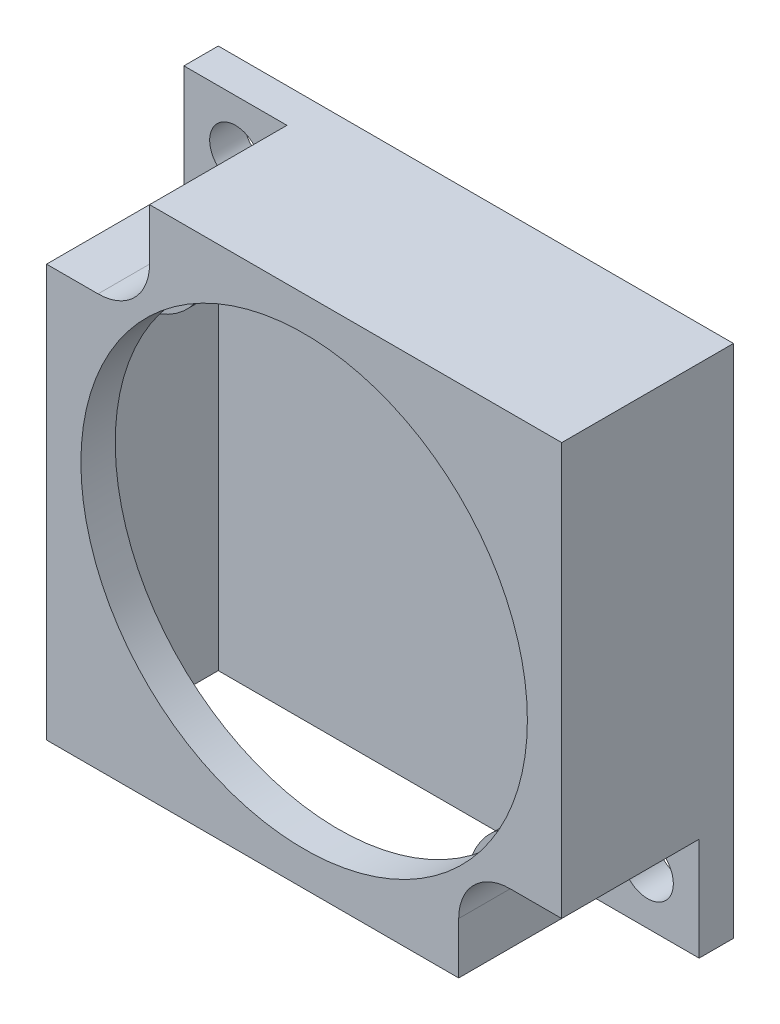
ISO-10303-21;
HEADER;
FILE_DESCRIPTION(('STEP AP214'),'2;1');
FILE_NAME('part.step','',(''),(''),'','','');
FILE_SCHEMA(('AUTOMOTIVE_DESIGN { 1 0 10303 214 1 1 1 1 }'));
ENDSEC;
DATA;
#1=APPLICATION_CONTEXT('core data for automotive mechanical design processes');
#2=APPLICATION_PROTOCOL_DEFINITION('international standard','automotive_design',2000,#1);
#3=PRODUCT_CONTEXT('',#1,'mechanical');
#4=PRODUCT('Part','Part','',(#3));
#5=PRODUCT_RELATED_PRODUCT_CATEGORY('part','',(#4));
#6=PRODUCT_DEFINITION_FORMATION('','',#4);
#7=PRODUCT_DEFINITION_CONTEXT('part definition',#1,'design');
#8=PRODUCT_DEFINITION('design','',#6,#7);
#9=PRODUCT_DEFINITION_SHAPE('','',#8);
#10=(LENGTH_UNIT() NAMED_UNIT(*) SI_UNIT(.MILLI.,.METRE.));
#11=(NAMED_UNIT(*) PLANE_ANGLE_UNIT() SI_UNIT($,.RADIAN.));
#12=(NAMED_UNIT(*) SI_UNIT($,.STERADIAN.) SOLID_ANGLE_UNIT());
#13=UNCERTAINTY_MEASURE_WITH_UNIT(LENGTH_MEASURE(1.E-05),#10,'distance_accuracy_value','');
#14=(GEOMETRIC_REPRESENTATION_CONTEXT(3) GLOBAL_UNCERTAINTY_ASSIGNED_CONTEXT((#13)) GLOBAL_UNIT_ASSIGNED_CONTEXT((#10,
#11,#12)) REPRESENTATION_CONTEXT('',''));
#15=CARTESIAN_POINT('',(0.,0.,0.));
#16=DIRECTION('',(0.,0.,1.));
#17=DIRECTION('',(1.,0.,0.));
#18=AXIS2_PLACEMENT_3D('',#15,#16,#17);
#19=CARTESIAN_POINT('',(0.,-15.,10.));
#20=DIRECTION('',(0.,1.,0.));
#21=DIRECTION('',(0.,0.,1.));
#22=AXIS2_PLACEMENT_3D('',#19,#20,#21);
#23=PLANE('',#22);
#24=DIRECTION('',(1.,0.,0.));
#25=VECTOR('',#24,1.);
#26=CARTESIAN_POINT('',(0.,-15.,0.));
#27=LINE('',#26,#25);
#28=CARTESIAN_POINT('',(-15.,-15.,0.));
#29=VERTEX_POINT('',#28);
#30=CARTESIAN_POINT('',(15.,-15.,0.));
#31=VERTEX_POINT('',#30);
#32=EDGE_CURVE('E458',#29,#31,#27,.T.);
#33=ORIENTED_EDGE('',*,*,#32,.T.);
#34=DIRECTION('',(0.,0.,-1.));
#35=VECTOR('',#34,1.);
#36=CARTESIAN_POINT('',(15.,-15.,2.));
#37=LINE('',#36,#35);
#38=CARTESIAN_POINT('',(15.,-15.,2.));
#39=VERTEX_POINT('',#38);
#40=EDGE_CURVE('E427',#39,#31,#37,.T.);
#41=ORIENTED_EDGE('',*,*,#40,.F.);
#42=DIRECTION('',(1.,0.,0.));
#43=VECTOR('',#42,1.);
#44=CARTESIAN_POINT('',(0.,-15.,2.));
#45=LINE('',#44,#43);
#46=CARTESIAN_POINT('',(8.99999999999999,-15.,2.));
#47=VERTEX_POINT('',#46);
#48=EDGE_CURVE('E417',#47,#39,#45,.T.);
#49=ORIENTED_EDGE('',*,*,#48,.F.);
#50=DIRECTION('',(0.,0.,-1.));
#51=VECTOR('',#50,1.);
#52=CARTESIAN_POINT('',(8.99999999999999,-15.,10.));
#53=LINE('',#52,#51);
#54=CARTESIAN_POINT('',(8.99999999999999,-15.,10.));
#55=VERTEX_POINT('',#54);
#56=EDGE_CURVE('E480',#55,#47,#53,.T.);
#57=ORIENTED_EDGE('',*,*,#56,.F.);
#58=DIRECTION('',(1.,0.,0.));
#59=VECTOR('',#58,1.);
#60=CARTESIAN_POINT('',(0.,-15.,10.));
#61=LINE('',#60,#59);
#62=CARTESIAN_POINT('',(-15.,-15.,10.));
#63=VERTEX_POINT('',#62);
#64=EDGE_CURVE('E478',#63,#55,#61,.T.);
#65=ORIENTED_EDGE('',*,*,#64,.F.);
#66=DIRECTION('',(0.,0.,-1.));
#67=VECTOR('',#66,1.);
#68=CARTESIAN_POINT('',(-15.,-15.,10.));
#69=LINE('',#68,#67);
#70=EDGE_CURVE('E490',#63,#29,#69,.T.);
#71=ORIENTED_EDGE('',*,*,#70,.T.);
#72=EDGE_LOOP('',(#33,#41,#49,#57,#65,#71));
#73=FACE_BOUND('',#72,.T.);
#74=DIRECTION('',(1.,0.,0.));
#75=VECTOR('',#74,1.);
#76=CARTESIAN_POINT('',(0.,-15.,1.5));
#77=LINE('',#76,#75);
#78=CARTESIAN_POINT('',(-13.5,-15.,1.5));
#79=VERTEX_POINT('',#78);
#80=CARTESIAN_POINT('',(7.49999999999999,-15.,1.5));
#81=VERTEX_POINT('',#80);
#82=EDGE_CURVE('E322',#79,#81,#77,.T.);
#83=ORIENTED_EDGE('',*,*,#82,.F.);
#84=DIRECTION('',(0.,0.,-1.));
#85=VECTOR('',#84,1.);
#86=CARTESIAN_POINT('',(-13.5,-15.,10.));
#87=LINE('',#86,#85);
#88=CARTESIAN_POINT('',(-13.5,-15.,8.5));
#89=VERTEX_POINT('',#88);
#90=EDGE_CURVE('E318',#89,#79,#87,.T.);
#91=ORIENTED_EDGE('',*,*,#90,.F.);
#92=DIRECTION('',(1.,0.,0.));
#93=VECTOR('',#92,1.);
#94=CARTESIAN_POINT('',(0.,-15.,8.5));
#95=LINE('',#94,#93);
#96=CARTESIAN_POINT('',(7.49999999999999,-15.,8.5));
#97=VERTEX_POINT('',#96);
#98=EDGE_CURVE('E53',#89,#97,#95,.T.);
#99=ORIENTED_EDGE('',*,*,#98,.T.);
#100=DIRECTION('',(0.,0.,-1.));
#101=VECTOR('',#100,1.);
#102=CARTESIAN_POINT('',(7.49999999999999,-15.,10.));
#103=LINE('',#102,#101);
#104=EDGE_CURVE('E332',#97,#81,#103,.T.);
#105=ORIENTED_EDGE('',*,*,#104,.T.);
#106=EDGE_LOOP('',(#83,#91,#99,#105));
#107=FACE_BOUND('',#106,.T.);
#108=ADVANCED_FACE('F34',(#73,#107),#23,.F.);
#109=CARTESIAN_POINT('',(0.,0.,8.));
#110=DIRECTION('',(0.,0.,1.));
#111=DIRECTION('',(1.,0.,0.));
#112=AXIS2_PLACEMENT_3D('',#109,#110,#111);
#113=PLANE('',#112);
#114=CARTESIAN_POINT('',(-12.,12.,8.));
#115=DIRECTION('',(0.,0.,1.));
#116=DIRECTION('',(1.,0.,0.));
#117=AXIS2_PLACEMENT_3D('',#114,#115,#116);
#118=CIRCLE('',#117,4.5);
#119=CARTESIAN_POINT('',(-7.79168741716336,10.4062292495033,8.));
#120=VERTEX_POINT('',#119);
#121=CARTESIAN_POINT('',(-10.4062292495033,7.79168741716336,8.));
#122=VERTEX_POINT('',#121);
#123=EDGE_CURVE('E43',#120,#122,#118,.F.);
#124=ORIENTED_EDGE('',*,*,#123,.F.);
#125=CARTESIAN_POINT('',(0.,0.,8.));
#126=DIRECTION('',(0.,0.,1.));
#127=DIRECTION('',(1.,0.,0.));
#128=AXIS2_PLACEMENT_3D('',#125,#126,#127);
#129=CIRCLE('',#128,13.);
#130=EDGE_CURVE('E404',#120,#122,#129,.T.);
#131=ORIENTED_EDGE('',*,*,#130,.T.);
#132=EDGE_LOOP('',(#124,#131));
#133=FACE_BOUND('',#132,.T.);
#134=ADVANCED_FACE('F551',(#133),#113,.T.);
#135=CARTESIAN_POINT('',(8.99999999999998,0.,10.));
#136=DIRECTION('',(1.,0.,0.));
#137=DIRECTION('',(0.,1.,0.));
#138=AXIS2_PLACEMENT_3D('',#135,#136,#137);
#139=PLANE('',#138);
#140=DIRECTION('',(0.,-1.,0.));
#141=VECTOR('',#140,1.);
#142=CARTESIAN_POINT('',(8.99999999999998,0.,2.));
#143=LINE('',#142,#141);
#144=CARTESIAN_POINT('',(8.99999999999999,-12.,2.));
#145=VERTEX_POINT('',#144);
#146=EDGE_CURVE('E414',#145,#47,#143,.T.);
#147=ORIENTED_EDGE('',*,*,#146,.F.);
#148=DIRECTION('',(0.,0.,-1.));
#149=VECTOR('',#148,1.);
#150=CARTESIAN_POINT('',(8.99999999999999,-12.,10.));
#151=LINE('',#150,#149);
#152=CARTESIAN_POINT('',(8.99999999999999,-12.,10.));
#153=VERTEX_POINT('',#152);
#154=EDGE_CURVE('E38',#153,#145,#151,.T.);
#155=ORIENTED_EDGE('',*,*,#154,.F.);
#156=DIRECTION('',(0.,-1.,0.));
#157=VECTOR('',#156,1.);
#158=CARTESIAN_POINT('',(8.99999999999998,0.,10.));
#159=LINE('',#158,#157);
#160=EDGE_CURVE('E454',#153,#55,#159,.T.);
#161=ORIENTED_EDGE('',*,*,#160,.T.);
#162=ORIENTED_EDGE('',*,*,#56,.T.);
#163=EDGE_LOOP('',(#147,#155,#161,#162));
#164=FACE_BOUND('',#163,.T.);
#165=ADVANCED_FACE('F36',(#164),#139,.T.);
#166=CARTESIAN_POINT('',(12.,-12.,10.));
#167=DIRECTION('',(0.,0.,-1.));
#168=DIRECTION('',(-1.,0.,0.));
#169=AXIS2_PLACEMENT_3D('',#166,#167,#168);
#170=CYLINDRICAL_SURFACE('',#169,2.99999999999999);
#171=ORIENTED_EDGE('',*,*,#154,.T.);
#172=CARTESIAN_POINT('',(12.,-12.,2.));
#173=DIRECTION('',(0.,0.,1.));
#174=DIRECTION('',(1.,0.,0.));
#175=AXIS2_PLACEMENT_3D('',#172,#173,#174);
#176=CIRCLE('',#175,2.99999999999999);
#177=CARTESIAN_POINT('',(12.,-9.00000000000001,2.));
#178=VERTEX_POINT('',#177);
#179=EDGE_CURVE('E412',#145,#178,#176,.F.);
#180=ORIENTED_EDGE('',*,*,#179,.T.);
#181=DIRECTION('',(0.,0.,-1.));
#182=VECTOR('',#181,1.);
#183=CARTESIAN_POINT('',(12.,-9.00000000000001,10.));
#184=LINE('',#183,#182);
#185=CARTESIAN_POINT('',(12.,-9.00000000000001,10.));
#186=VERTEX_POINT('',#185);
#187=EDGE_CURVE('E509',#186,#178,#184,.T.);
#188=ORIENTED_EDGE('',*,*,#187,.F.);
#189=CARTESIAN_POINT('',(12.,-12.,10.));
#190=DIRECTION('',(0.,0.,1.));
#191=DIRECTION('',(1.,0.,0.));
#192=AXIS2_PLACEMENT_3D('',#189,#190,#191);
#193=CIRCLE('',#192,2.99999999999999);
#194=EDGE_CURVE('E457',#153,#186,#193,.F.);
#195=ORIENTED_EDGE('',*,*,#194,.F.);
#196=EDGE_LOOP('',(#171,#180,#188,#195));
#197=FACE_BOUND('',#196,.T.);
#198=ADVANCED_FACE('F657',(#197),#170,.F.);
#199=CARTESIAN_POINT('',(0.,-9.00000000000003,10.));
#200=DIRECTION('',(0.,1.,0.));
#201=DIRECTION('',(-1.,0.,0.));
#202=AXIS2_PLACEMENT_3D('',#199,#200,#201);
#203=PLANE('',#202);
#204=ORIENTED_EDGE('',*,*,#187,.T.);
#205=DIRECTION('',(1.,0.,0.));
#206=VECTOR('',#205,1.);
#207=CARTESIAN_POINT('',(0.,-9.00000000000003,2.));
#208=LINE('',#207,#206);
#209=CARTESIAN_POINT('',(15.,-9.00000000000001,2.));
#210=VERTEX_POINT('',#209);
#211=EDGE_CURVE('E422',#178,#210,#208,.T.);
#212=ORIENTED_EDGE('',*,*,#211,.T.);
#213=DIRECTION('',(0.,0.,-1.));
#214=VECTOR('',#213,1.);
#215=CARTESIAN_POINT('',(15.,-9.00000000000001,10.));
#216=LINE('',#215,#214);
#217=CARTESIAN_POINT('',(15.,-9.00000000000001,10.));
#218=VERTEX_POINT('',#217);
#219=EDGE_CURVE('E507',#218,#210,#216,.T.);
#220=ORIENTED_EDGE('',*,*,#219,.F.);
#221=DIRECTION('',(1.,0.,0.));
#222=VECTOR('',#221,1.);
#223=CARTESIAN_POINT('',(0.,-9.00000000000003,10.));
#224=LINE('',#223,#222);
#225=EDGE_CURVE('E460',#186,#218,#224,.T.);
#226=ORIENTED_EDGE('',*,*,#225,.F.);
#227=EDGE_LOOP('',(#204,#212,#220,#226));
#228=FACE_BOUND('',#227,.T.);
#229=ADVANCED_FACE('F654',(#228),#203,.F.);
#230=CARTESIAN_POINT('',(15.,0.,10.));
#231=DIRECTION('',(1.,0.,0.));
#232=DIRECTION('',(0.,1.,0.));
#233=AXIS2_PLACEMENT_3D('',#230,#231,#232);
#234=PLANE('',#233);
#235=DIRECTION('',(0.,-1.,0.));
#236=VECTOR('',#235,1.);
#237=CARTESIAN_POINT('',(15.,0.,0.));
#238=LINE('',#237,#236);
#239=CARTESIAN_POINT('',(15.,15.,0.));
#240=VERTEX_POINT('',#239);
#241=EDGE_CURVE('E453',#240,#31,#238,.T.);
#242=ORIENTED_EDGE('',*,*,#241,.F.);
#243=DIRECTION('',(0.,0.,-1.));
#244=VECTOR('',#243,1.);
#245=CARTESIAN_POINT('',(15.,15.,10.));
#246=LINE('',#245,#244);
#247=CARTESIAN_POINT('',(15.,15.,10.));
#248=VERTEX_POINT('',#247);
#249=EDGE_CURVE('E505',#248,#240,#246,.T.);
#250=ORIENTED_EDGE('',*,*,#249,.F.);
#251=DIRECTION('',(0.,-1.,0.));
#252=VECTOR('',#251,1.);
#253=CARTESIAN_POINT('',(15.,0.,10.));
#254=LINE('',#253,#252);
#255=EDGE_CURVE('E462',#248,#218,#254,.T.);
#256=ORIENTED_EDGE('',*,*,#255,.T.);
#257=ORIENTED_EDGE('',*,*,#219,.T.);
#258=DIRECTION('',(0.,-1.,0.));
#259=VECTOR('',#258,1.);
#260=CARTESIAN_POINT('',(15.,0.,2.));
#261=LINE('',#260,#259);
#262=EDGE_CURVE('E419',#210,#39,#261,.T.);
#263=ORIENTED_EDGE('',*,*,#262,.T.);
#264=ORIENTED_EDGE('',*,*,#40,.T.);
#265=EDGE_LOOP('',(#242,#250,#256,#257,#263,#264));
#266=FACE_BOUND('',#265,.T.);
#267=ADVANCED_FACE('F650',(#266),#234,.T.);
#268=CARTESIAN_POINT('',(0.,15.,10.));
#269=DIRECTION('',(0.,1.,0.));
#270=DIRECTION('',(0.,0.,1.));
#271=AXIS2_PLACEMENT_3D('',#268,#269,#270);
#272=PLANE('',#271);
#273=DIRECTION('',(1.,0.,0.));
#274=VECTOR('',#273,1.);
#275=CARTESIAN_POINT('',(0.,15.,0.));
#276=LINE('',#275,#274);
#277=CARTESIAN_POINT('',(-15.,15.,0.));
#278=VERTEX_POINT('',#277);
#279=EDGE_CURVE('E483',#278,#240,#276,.T.);
#280=ORIENTED_EDGE('',*,*,#279,.F.);
#281=DIRECTION('',(0.,0.,-1.));
#282=VECTOR('',#281,1.);
#283=CARTESIAN_POINT('',(-15.,15.,2.));
#284=LINE('',#283,#282);
#285=CARTESIAN_POINT('',(-15.,15.,2.));
#286=VERTEX_POINT('',#285);
#287=EDGE_CURVE('E448',#286,#278,#284,.T.);
#288=ORIENTED_EDGE('',*,*,#287,.F.);
#289=DIRECTION('',(1.,0.,0.));
#290=VECTOR('',#289,1.);
#291=CARTESIAN_POINT('',(0.,15.,2.));
#292=LINE('',#291,#290);
#293=CARTESIAN_POINT('',(-9.,15.,2.));
#294=VERTEX_POINT('',#293);
#295=EDGE_CURVE('E443',#286,#294,#292,.T.);
#296=ORIENTED_EDGE('',*,*,#295,.T.);
#297=DIRECTION('',(0.,0.,-1.));
#298=VECTOR('',#297,1.);
#299=CARTESIAN_POINT('',(-9.,15.,10.));
#300=LINE('',#299,#298);
#301=CARTESIAN_POINT('',(-9.,15.,10.));
#302=VERTEX_POINT('',#301);
#303=EDGE_CURVE('E502',#302,#294,#300,.T.);
#304=ORIENTED_EDGE('',*,*,#303,.F.);
#305=DIRECTION('',(1.,0.,0.));
#306=VECTOR('',#305,1.);
#307=CARTESIAN_POINT('',(0.,15.,10.));
#308=LINE('',#307,#306);
#309=EDGE_CURVE('E465',#302,#248,#308,.T.);
#310=ORIENTED_EDGE('',*,*,#309,.T.);
#311=ORIENTED_EDGE('',*,*,#249,.T.);
#312=EDGE_LOOP('',(#280,#288,#296,#304,#310,#311));
#313=FACE_BOUND('',#312,.T.);
#314=ADVANCED_FACE('F646',(#313),#272,.T.);
#315=CARTESIAN_POINT('',(-9.,0.,10.));
#316=DIRECTION('',(-1.,0.,0.));
#317=DIRECTION('',(0.,0.,1.));
#318=AXIS2_PLACEMENT_3D('',#315,#316,#317);
#319=PLANE('',#318);
#320=DIRECTION('',(0.,1.,0.));
#321=VECTOR('',#320,1.);
#322=CARTESIAN_POINT('',(-9.,0.,2.));
#323=LINE('',#322,#321);
#324=CARTESIAN_POINT('',(-9.,12.,2.));
#325=VERTEX_POINT('',#324);
#326=EDGE_CURVE('E441',#325,#294,#323,.T.);
#327=ORIENTED_EDGE('',*,*,#326,.F.);
#328=DIRECTION('',(0.,0.,-1.));
#329=VECTOR('',#328,1.);
#330=CARTESIAN_POINT('',(-9.,12.,10.));
#331=LINE('',#330,#329);
#332=CARTESIAN_POINT('',(-9.,12.,10.));
#333=VERTEX_POINT('',#332);
#334=EDGE_CURVE('E499',#333,#325,#331,.T.);
#335=ORIENTED_EDGE('',*,*,#334,.F.);
#336=DIRECTION('',(0.,1.,0.));
#337=VECTOR('',#336,1.);
#338=CARTESIAN_POINT('',(-9.,0.,10.));
#339=LINE('',#338,#337);
#340=EDGE_CURVE('E468',#333,#302,#339,.T.);
#341=ORIENTED_EDGE('',*,*,#340,.T.);
#342=ORIENTED_EDGE('',*,*,#303,.T.);
#343=EDGE_LOOP('',(#327,#335,#341,#342));
#344=FACE_BOUND('',#343,.T.);
#345=ADVANCED_FACE('F642',(#344),#319,.T.);
#346=CARTESIAN_POINT('',(-12.,12.,10.));
#347=DIRECTION('',(0.,0.,-1.));
#348=DIRECTION('',(-1.,0.,0.));
#349=AXIS2_PLACEMENT_3D('',#346,#347,#348);
#350=CYLINDRICAL_SURFACE('',#349,3.);
#351=CARTESIAN_POINT('',(-12.,12.,2.));
#352=DIRECTION('',(0.,0.,1.));
#353=DIRECTION('',(1.,0.,0.));
#354=AXIS2_PLACEMENT_3D('',#351,#352,#353);
#355=CIRCLE('',#354,3.);
#356=CARTESIAN_POINT('',(-12.,9.,2.));
#357=VERTEX_POINT('',#356);
#358=EDGE_CURVE('E439',#357,#325,#355,.T.);
#359=ORIENTED_EDGE('',*,*,#358,.F.);
#360=DIRECTION('',(0.,0.,-1.));
#361=VECTOR('',#360,1.);
#362=CARTESIAN_POINT('',(-12.,9.,10.));
#363=LINE('',#362,#361);
#364=CARTESIAN_POINT('',(-12.,9.,10.));
#365=VERTEX_POINT('',#364);
#366=EDGE_CURVE('E496',#365,#357,#363,.T.);
#367=ORIENTED_EDGE('',*,*,#366,.F.);
#368=CARTESIAN_POINT('',(-12.,12.,10.));
#369=DIRECTION('',(0.,0.,1.));
#370=DIRECTION('',(1.,0.,0.));
#371=AXIS2_PLACEMENT_3D('',#368,#369,#370);
#372=CIRCLE('',#371,3.);
#373=EDGE_CURVE('E471',#365,#333,#372,.T.);
#374=ORIENTED_EDGE('',*,*,#373,.T.);
#375=ORIENTED_EDGE('',*,*,#334,.T.);
#376=EDGE_LOOP('',(#359,#367,#374,#375));
#377=FACE_BOUND('',#376,.T.);
#378=ADVANCED_FACE('F638',(#377),#350,.F.);
#379=CARTESIAN_POINT('',(0.,9.,10.));
#380=DIRECTION('',(0.,-1.,0.));
#381=DIRECTION('',(0.,0.,-1.));
#382=AXIS2_PLACEMENT_3D('',#379,#380,#381);
#383=PLANE('',#382);
#384=ORIENTED_EDGE('',*,*,#366,.T.);
#385=DIRECTION('',(-1.,0.,0.));
#386=VECTOR('',#385,1.);
#387=CARTESIAN_POINT('',(0.,9.,2.));
#388=LINE('',#387,#386);
#389=CARTESIAN_POINT('',(-15.,9.,2.));
#390=VERTEX_POINT('',#389);
#391=EDGE_CURVE('E436',#357,#390,#388,.T.);
#392=ORIENTED_EDGE('',*,*,#391,.T.);
#393=DIRECTION('',(0.,0.,-1.));
#394=VECTOR('',#393,1.);
#395=CARTESIAN_POINT('',(-15.,9.,10.));
#396=LINE('',#395,#394);
#397=CARTESIAN_POINT('',(-15.,9.,10.));
#398=VERTEX_POINT('',#397);
#399=EDGE_CURVE('E493',#398,#390,#396,.T.);
#400=ORIENTED_EDGE('',*,*,#399,.F.);
#401=DIRECTION('',(-1.,0.,0.));
#402=VECTOR('',#401,1.);
#403=CARTESIAN_POINT('',(0.,9.,10.));
#404=LINE('',#403,#402);
#405=EDGE_CURVE('E474',#365,#398,#404,.T.);
#406=ORIENTED_EDGE('',*,*,#405,.F.);
#407=EDGE_LOOP('',(#384,#392,#400,#406));
#408=FACE_BOUND('',#407,.T.);
#409=ADVANCED_FACE('F634',(#408),#383,.F.);
#410=CARTESIAN_POINT('',(-15.,0.,10.));
#411=DIRECTION('',(1.,0.,0.));
#412=DIRECTION('',(0.,1.,0.));
#413=AXIS2_PLACEMENT_3D('',#410,#411,#412);
#414=PLANE('',#413);
#415=DIRECTION('',(0.,-1.,0.));
#416=VECTOR('',#415,1.);
#417=CARTESIAN_POINT('',(-15.,0.,0.));
#418=LINE('',#417,#416);
#419=EDGE_CURVE('E486',#278,#29,#418,.T.);
#420=ORIENTED_EDGE('',*,*,#419,.T.);
#421=ORIENTED_EDGE('',*,*,#70,.F.);
#422=DIRECTION('',(0.,-1.,0.));
#423=VECTOR('',#422,1.);
#424=CARTESIAN_POINT('',(-15.,0.,10.));
#425=LINE('',#424,#423);
#426=EDGE_CURVE('E476',#398,#63,#425,.T.);
#427=ORIENTED_EDGE('',*,*,#426,.F.);
#428=ORIENTED_EDGE('',*,*,#399,.T.);
#429=DIRECTION('',(0.,-1.,0.));
#430=VECTOR('',#429,1.);
#431=CARTESIAN_POINT('',(-15.,0.,2.));
#432=LINE('',#431,#430);
#433=EDGE_CURVE('E446',#286,#390,#432,.T.);
#434=ORIENTED_EDGE('',*,*,#433,.F.);
#435=ORIENTED_EDGE('',*,*,#287,.T.);
#436=EDGE_LOOP('',(#420,#421,#427,#428,#434,#435));
#437=FACE_BOUND('',#436,.T.);
#438=ADVANCED_FACE('F630',(#437),#414,.F.);
#439=CARTESIAN_POINT('',(0.,0.,10.));
#440=DIRECTION('',(0.,0.,1.));
#441=DIRECTION('',(1.,0.,0.));
#442=AXIS2_PLACEMENT_3D('',#439,#440,#441);
#443=PLANE('',#442);
#444=CARTESIAN_POINT('',(0.,0.,10.));
#445=DIRECTION('',(0.,0.,1.));
#446=DIRECTION('',(1.,0.,0.));
#447=AXIS2_PLACEMENT_3D('',#444,#445,#446);
#448=CIRCLE('',#447,13.);
#449=CARTESIAN_POINT('',(13.,0.,10.));
#450=VERTEX_POINT('',#449);
#451=EDGE_CURVE('E403',#450,#450,#448,.T.);
#452=ORIENTED_EDGE('',*,*,#451,.F.);
#453=EDGE_LOOP('',(#452));
#454=FACE_BOUND('',#453,.T.);
#455=ORIENTED_EDGE('',*,*,#160,.F.);
#456=ORIENTED_EDGE('',*,*,#194,.T.);
#457=ORIENTED_EDGE('',*,*,#225,.T.);
#458=ORIENTED_EDGE('',*,*,#255,.F.);
#459=ORIENTED_EDGE('',*,*,#309,.F.);
#460=ORIENTED_EDGE('',*,*,#340,.F.);
#461=ORIENTED_EDGE('',*,*,#373,.F.);
#462=ORIENTED_EDGE('',*,*,#405,.T.);
#463=ORIENTED_EDGE('',*,*,#426,.T.);
#464=ORIENTED_EDGE('',*,*,#64,.T.);
#465=EDGE_LOOP('',(#455,#456,#457,#458,#459,#460,#461,#462,#463,#464));
#466=FACE_BOUND('',#465,.T.);
#467=ADVANCED_FACE('F633',(#454,#466),#443,.T.);
#468=CARTESIAN_POINT('',(0.,0.,0.));
#469=DIRECTION('',(0.,0.,1.));
#470=DIRECTION('',(1.,0.,0.));
#471=AXIS2_PLACEMENT_3D('',#468,#469,#470);
#472=PLANE('',#471);
#473=ORIENTED_EDGE('',*,*,#241,.T.);
#474=ORIENTED_EDGE('',*,*,#32,.F.);
#475=ORIENTED_EDGE('',*,*,#419,.F.);
#476=ORIENTED_EDGE('',*,*,#279,.T.);
#477=EDGE_LOOP('',(#473,#474,#475,#476));
#478=FACE_BOUND('',#477,.T.);
#479=CARTESIAN_POINT('',(-12.,12.,0.));
#480=DIRECTION('',(0.,0.,1.));
#481=DIRECTION('',(1.,0.,0.));
#482=AXIS2_PLACEMENT_3D('',#479,#480,#481);
#483=CIRCLE('',#482,1.5);
#484=CARTESIAN_POINT('',(-10.5,12.,0.));
#485=VERTEX_POINT('',#484);
#486=EDGE_CURVE('E432',#485,#485,#483,.T.);
#487=ORIENTED_EDGE('',*,*,#486,.T.);
#488=EDGE_LOOP('',(#487));
#489=FACE_BOUND('',#488,.T.);
#490=CARTESIAN_POINT('',(12.,-12.,0.));
#491=DIRECTION('',(0.,0.,1.));
#492=DIRECTION('',(1.,0.,0.));
#493=AXIS2_PLACEMENT_3D('',#490,#491,#492);
#494=CIRCLE('',#493,1.5);
#495=CARTESIAN_POINT('',(13.5,-12.,0.));
#496=VERTEX_POINT('',#495);
#497=EDGE_CURVE('E407',#496,#496,#494,.T.);
#498=ORIENTED_EDGE('',*,*,#497,.T.);
#499=EDGE_LOOP('',(#498));
#500=FACE_BOUND('',#499,.T.);
#501=ADVANCED_FACE('F628',(#478,#489,#500),#472,.F.);
#502=CARTESIAN_POINT('',(-12.,12.,2.));
#503=DIRECTION('',(0.,0.,-1.));
#504=DIRECTION('',(-1.,0.,0.));
#505=AXIS2_PLACEMENT_3D('',#502,#503,#504);
#506=CYLINDRICAL_SURFACE('',#505,1.5);
#507=CARTESIAN_POINT('',(-12.,12.,2.));
#508=DIRECTION('',(0.,0.,1.));
#509=DIRECTION('',(1.,0.,0.));
#510=AXIS2_PLACEMENT_3D('',#507,#508,#509);
#511=CIRCLE('',#510,1.5);
#512=CARTESIAN_POINT('',(-10.5,12.,2.));
#513=VERTEX_POINT('',#512);
#514=EDGE_CURVE('E433',#513,#513,#511,.T.);
#515=ORIENTED_EDGE('',*,*,#514,.T.);
#516=EDGE_LOOP('',(#515));
#517=FACE_BOUND('',#516,.T.);
#518=ORIENTED_EDGE('',*,*,#486,.F.);
#519=EDGE_LOOP('',(#518));
#520=FACE_BOUND('',#519,.T.);
#521=ADVANCED_FACE('F697',(#517,#520),#506,.F.);
#522=CARTESIAN_POINT('',(0.,0.,2.));
#523=DIRECTION('',(0.,0.,1.));
#524=DIRECTION('',(1.,0.,0.));
#525=AXIS2_PLACEMENT_3D('',#522,#523,#524);
#526=PLANE('',#525);
#527=ORIENTED_EDGE('',*,*,#514,.F.);
#528=EDGE_LOOP('',(#527));
#529=FACE_BOUND('',#528,.T.);
#530=ORIENTED_EDGE('',*,*,#391,.F.);
#531=ORIENTED_EDGE('',*,*,#358,.T.);
#532=ORIENTED_EDGE('',*,*,#326,.T.);
#533=ORIENTED_EDGE('',*,*,#295,.F.);
#534=ORIENTED_EDGE('',*,*,#433,.T.);
#535=EDGE_LOOP('',(#530,#531,#532,#533,#534));
#536=FACE_BOUND('',#535,.T.);
#537=ADVANCED_FACE('F694',(#529,#536),#526,.T.);
#538=CARTESIAN_POINT('',(12.,-12.,2.));
#539=DIRECTION('',(0.,0.,-1.));
#540=DIRECTION('',(-1.,0.,0.));
#541=AXIS2_PLACEMENT_3D('',#538,#539,#540);
#542=CYLINDRICAL_SURFACE('',#541,1.5);
#543=CARTESIAN_POINT('',(12.,-12.,2.));
#544=DIRECTION('',(0.,0.,1.));
#545=DIRECTION('',(1.,0.,0.));
#546=AXIS2_PLACEMENT_3D('',#543,#544,#545);
#547=CIRCLE('',#546,1.5);
#548=CARTESIAN_POINT('',(13.5,-12.,2.));
#549=VERTEX_POINT('',#548);
#550=EDGE_CURVE('E424',#549,#549,#547,.T.);
#551=ORIENTED_EDGE('',*,*,#550,.T.);
#552=EDGE_LOOP('',(#551));
#553=FACE_BOUND('',#552,.T.);
#554=ORIENTED_EDGE('',*,*,#497,.F.);
#555=EDGE_LOOP('',(#554));
#556=FACE_BOUND('',#555,.T.);
#557=ADVANCED_FACE('F696',(#553,#556),#542,.F.);
#558=CARTESIAN_POINT('',(0.,0.,2.));
#559=DIRECTION('',(0.,0.,1.));
#560=DIRECTION('',(1.,0.,0.));
#561=AXIS2_PLACEMENT_3D('',#558,#559,#560);
#562=PLANE('',#561);
#563=ORIENTED_EDGE('',*,*,#179,.F.);
#564=ORIENTED_EDGE('',*,*,#146,.T.);
#565=ORIENTED_EDGE('',*,*,#48,.T.);
#566=ORIENTED_EDGE('',*,*,#262,.F.);
#567=ORIENTED_EDGE('',*,*,#211,.F.);
#568=EDGE_LOOP('',(#563,#564,#565,#566,#567));
#569=FACE_BOUND('',#568,.T.);
#570=ORIENTED_EDGE('',*,*,#550,.F.);
#571=EDGE_LOOP('',(#570));
#572=FACE_BOUND('',#571,.T.);
#573=ADVANCED_FACE('F668',(#569,#572),#562,.T.);
#574=CARTESIAN_POINT('',(0.,0.,8.));
#575=DIRECTION('',(0.,0.,1.));
#576=DIRECTION('',(1.,0.,0.));
#577=AXIS2_PLACEMENT_3D('',#574,#575,#576);
#578=CYLINDRICAL_SURFACE('',#577,13.);
#579=ORIENTED_EDGE('',*,*,#130,.F.);
#580=CARTESIAN_POINT('',(10.4062292495033,-7.79168741716335,8.));
#581=VERTEX_POINT('',#580);
#582=EDGE_CURVE('E409',#581,#120,#129,.T.);
#583=ORIENTED_EDGE('',*,*,#582,.F.);
#584=CARTESIAN_POINT('',(7.79168741716335,-10.4062292495033,8.));
#585=VERTEX_POINT('',#584);
#586=EDGE_CURVE('E549',#585,#581,#129,.T.);
#587=ORIENTED_EDGE('',*,*,#586,.F.);
#588=EDGE_CURVE('E408',#122,#585,#129,.T.);
#589=ORIENTED_EDGE('',*,*,#588,.F.);
#590=EDGE_LOOP('',(#579,#583,#587,#589));
#591=FACE_BOUND('',#590,.T.);
#592=ORIENTED_EDGE('',*,*,#451,.T.);
#593=EDGE_LOOP('',(#592));
#594=FACE_BOUND('',#593,.T.);
#595=ADVANCED_FACE('F552',(#591,#594),#578,.F.);
#596=ORIENTED_EDGE('',*,*,#586,.T.);
#597=CARTESIAN_POINT('',(12.,-12.,8.));
#598=DIRECTION('',(0.,0.,1.));
#599=DIRECTION('',(1.,0.,0.));
#600=AXIS2_PLACEMENT_3D('',#597,#598,#599);
#601=CIRCLE('',#600,4.49999999999999);
#602=EDGE_CURVE('E11',#581,#585,#601,.T.);
#603=ORIENTED_EDGE('',*,*,#602,.T.);
#604=EDGE_LOOP('',(#596,#603));
#605=FACE_BOUND('',#604,.T.);
#606=ADVANCED_FACE('F556',(#605),#113,.T.);
#607=CARTESIAN_POINT('',(0.,0.,8.));
#608=DIRECTION('',(0.,0.,1.));
#609=DIRECTION('',(1.,0.,0.));
#610=AXIS2_PLACEMENT_3D('',#607,#608,#609);
#611=PLANE('',#610);
#612=ORIENTED_EDGE('',*,*,#588,.T.);
#613=CARTESIAN_POINT('',(7.5,-12.,8.));
#614=VERTEX_POINT('',#613);
#615=EDGE_CURVE('E46',#585,#614,#601,.T.);
#616=ORIENTED_EDGE('',*,*,#615,.T.);
#617=DIRECTION('',(0.,-1.,0.));
#618=VECTOR('',#617,1.);
#619=CARTESIAN_POINT('',(7.49999999999998,0.,8.));
#620=LINE('',#619,#618);
#621=CARTESIAN_POINT('',(7.49999999999999,-12.4096736459909,8.));
#622=VERTEX_POINT('',#621);
#623=EDGE_CURVE('E375',#614,#622,#620,.T.);
#624=ORIENTED_EDGE('',*,*,#623,.T.);
#625=CARTESIAN_POINT('',(0.,0.,8.));
#626=DIRECTION('',(0.,0.,1.));
#627=DIRECTION('',(1.,0.,0.));
#628=AXIS2_PLACEMENT_3D('',#625,#626,#627);
#629=CIRCLE('',#628,14.5);
#630=CARTESIAN_POINT('',(-13.5,-5.29150262212918,8.));
#631=VERTEX_POINT('',#630);
#632=EDGE_CURVE('E329',#631,#622,#629,.T.);
#633=ORIENTED_EDGE('',*,*,#632,.F.);
#634=DIRECTION('',(0.,-1.,0.));
#635=VECTOR('',#634,1.);
#636=CARTESIAN_POINT('',(-13.5,0.,8.));
#637=LINE('',#636,#635);
#638=CARTESIAN_POINT('',(-13.5,5.29150262212917,8.));
#639=VERTEX_POINT('',#638);
#640=EDGE_CURVE('E400',#639,#631,#637,.T.);
#641=ORIENTED_EDGE('',*,*,#640,.F.);
#642=CARTESIAN_POINT('',(-12.4096736459909,7.5,8.));
#643=VERTEX_POINT('',#642);
#644=EDGE_CURVE('E342',#643,#639,#629,.T.);
#645=ORIENTED_EDGE('',*,*,#644,.F.);
#646=DIRECTION('',(1.,0.,0.));
#647=VECTOR('',#646,1.);
#648=CARTESIAN_POINT('',(0.,7.5,8.));
#649=LINE('',#648,#647);
#650=CARTESIAN_POINT('',(-12.,7.5,8.));
#651=VERTEX_POINT('',#650);
#652=EDGE_CURVE('E382',#643,#651,#649,.T.);
#653=ORIENTED_EDGE('',*,*,#652,.T.);
#654=EDGE_CURVE('E385',#122,#651,#118,.F.);
#655=ORIENTED_EDGE('',*,*,#654,.F.);
#656=EDGE_LOOP('',(#612,#616,#624,#633,#641,#645,#653,#655));
#657=FACE_BOUND('',#656,.T.);
#658=ADVANCED_FACE('F525',(#657),#611,.F.);
#659=CARTESIAN_POINT('',(-13.5,0.,10.));
#660=DIRECTION('',(1.,0.,0.));
#661=DIRECTION('',(0.,1.,0.));
#662=AXIS2_PLACEMENT_3D('',#659,#660,#661);
#663=PLANE('',#662);
#664=ORIENTED_EDGE('',*,*,#640,.T.);
#665=DIRECTION('',(0.,0.,1.));
#666=VECTOR('',#665,1.);
#667=CARTESIAN_POINT('',(-13.5,-5.29150262212918,8.));
#668=LINE('',#667,#666);
#669=CARTESIAN_POINT('',(-13.5,-5.29150262212918,8.5));
#670=VERTEX_POINT('',#669);
#671=EDGE_CURVE('E370',#631,#670,#668,.T.);
#672=ORIENTED_EDGE('',*,*,#671,.T.);
#673=DIRECTION('',(0.,-1.,0.));
#674=VECTOR('',#673,1.);
#675=CARTESIAN_POINT('',(-13.5,0.,8.5));
#676=LINE('',#675,#674);
#677=EDGE_CURVE('E320',#670,#89,#676,.T.);
#678=ORIENTED_EDGE('',*,*,#677,.T.);
#679=ORIENTED_EDGE('',*,*,#90,.T.);
#680=DIRECTION('',(0.,-1.,0.));
#681=VECTOR('',#680,1.);
#682=CARTESIAN_POINT('',(-13.5,0.,1.5));
#683=LINE('',#682,#681);
#684=CARTESIAN_POINT('',(-13.5,7.5,1.5));
#685=VERTEX_POINT('',#684);
#686=EDGE_CURVE('E300',#685,#79,#683,.T.);
#687=ORIENTED_EDGE('',*,*,#686,.F.);
#688=DIRECTION('',(0.,0.,-1.));
#689=VECTOR('',#688,1.);
#690=CARTESIAN_POINT('',(-13.5,7.5,10.));
#691=LINE('',#690,#689);
#692=CARTESIAN_POINT('',(-13.5,7.5,8.5));
#693=VERTEX_POINT('',#692);
#694=EDGE_CURVE('E315',#693,#685,#691,.T.);
#695=ORIENTED_EDGE('',*,*,#694,.F.);
#696=CARTESIAN_POINT('',(-13.5,5.29150262212917,8.5));
#697=VERTEX_POINT('',#696);
#698=EDGE_CURVE('E323',#693,#697,#676,.T.);
#699=ORIENTED_EDGE('',*,*,#698,.T.);
#700=DIRECTION('',(0.,0.,1.));
#701=VECTOR('',#700,1.);
#702=CARTESIAN_POINT('',(-13.5,5.29150262212917,8.));
#703=LINE('',#702,#701);
#704=EDGE_CURVE('E372',#697,#639,#703,.F.);
#705=ORIENTED_EDGE('',*,*,#704,.T.);
#706=EDGE_LOOP('',(#664,#672,#678,#679,#687,#695,#699,#705));
#707=FACE_BOUND('',#706,.T.);
#708=ADVANCED_FACE('F573',(#707),#663,.T.);
#709=ORIENTED_EDGE('',*,*,#582,.T.);
#710=CARTESIAN_POINT('',(-7.5,12.,8.));
#711=VERTEX_POINT('',#710);
#712=EDGE_CURVE('E61',#711,#120,#118,.F.);
#713=ORIENTED_EDGE('',*,*,#712,.F.);
#714=DIRECTION('',(0.,-1.,0.));
#715=VECTOR('',#714,1.);
#716=CARTESIAN_POINT('',(-7.5,0.,8.));
#717=LINE('',#716,#715);
#718=CARTESIAN_POINT('',(-7.5,12.4096736459909,8.));
#719=VERTEX_POINT('',#718);
#720=EDGE_CURVE('E380',#719,#711,#717,.T.);
#721=ORIENTED_EDGE('',*,*,#720,.F.);
#722=CARTESIAN_POINT('',(-5.29150262212917,13.5,8.));
#723=VERTEX_POINT('',#722);
#724=EDGE_CURVE('E343',#723,#719,#629,.T.);
#725=ORIENTED_EDGE('',*,*,#724,.F.);
#726=DIRECTION('',(1.,0.,0.));
#727=VECTOR('',#726,1.);
#728=CARTESIAN_POINT('',(0.,13.5,8.));
#729=LINE('',#728,#727);
#730=CARTESIAN_POINT('',(5.29150262212917,13.5,8.));
#731=VERTEX_POINT('',#730);
#732=EDGE_CURVE('E397',#723,#731,#729,.T.);
#733=ORIENTED_EDGE('',*,*,#732,.T.);
#734=CARTESIAN_POINT('',(13.5,5.29150262212919,8.));
#735=VERTEX_POINT('',#734);
#736=EDGE_CURVE('E578',#735,#731,#629,.T.);
#737=ORIENTED_EDGE('',*,*,#736,.F.);
#738=DIRECTION('',(0.,-1.,0.));
#739=VECTOR('',#738,1.);
#740=CARTESIAN_POINT('',(13.5,0.,8.));
#741=LINE('',#740,#739);
#742=CARTESIAN_POINT('',(13.5,-5.29150262212919,8.));
#743=VERTEX_POINT('',#742);
#744=EDGE_CURVE('E394',#735,#743,#741,.T.);
#745=ORIENTED_EDGE('',*,*,#744,.T.);
#746=CARTESIAN_POINT('',(12.4096736459909,-7.50000000000001,8.));
#747=VERTEX_POINT('',#746);
#748=EDGE_CURVE('E344',#747,#743,#629,.T.);
#749=ORIENTED_EDGE('',*,*,#748,.F.);
#750=DIRECTION('',(-1.,0.,0.));
#751=VECTOR('',#750,1.);
#752=CARTESIAN_POINT('',(0.,-7.50000000000003,8.));
#753=LINE('',#752,#751);
#754=CARTESIAN_POINT('',(12.,-7.50000000000001,8.));
#755=VERTEX_POINT('',#754);
#756=EDGE_CURVE('E377',#747,#755,#753,.T.);
#757=ORIENTED_EDGE('',*,*,#756,.T.);
#758=EDGE_CURVE('E45',#755,#581,#601,.T.);
#759=ORIENTED_EDGE('',*,*,#758,.T.);
#760=EDGE_LOOP('',(#709,#713,#721,#725,#733,#737,#745,#749,#757,#759));
#761=FACE_BOUND('',#760,.T.);
#762=ADVANCED_FACE('F543',(#761),#611,.F.);
#763=CARTESIAN_POINT('',(12.,-12.,10.));
#764=DIRECTION('',(0.,0.,-1.));
#765=DIRECTION('',(-1.,0.,0.));
#766=AXIS2_PLACEMENT_3D('',#763,#764,#765);
#767=CYLINDRICAL_SURFACE('',#766,4.49999999999999);
#768=CARTESIAN_POINT('',(12.,-12.,1.5));
#769=DIRECTION('',(0.,0.,1.));
#770=DIRECTION('',(1.,0.,0.));
#771=AXIS2_PLACEMENT_3D('',#768,#769,#770);
#772=CIRCLE('',#771,4.49999999999999);
#773=CARTESIAN_POINT('',(12.,-7.50000000000001,1.5));
#774=VERTEX_POINT('',#773);
#775=CARTESIAN_POINT('',(7.5,-12.,1.5));
#776=VERTEX_POINT('',#775);
#777=EDGE_CURVE('E388',#774,#776,#772,.T.);
#778=ORIENTED_EDGE('',*,*,#777,.T.);
#779=DIRECTION('',(0.,0.,-1.));
#780=VECTOR('',#779,1.);
#781=CARTESIAN_POINT('',(7.5,-12.,10.));
#782=LINE('',#781,#780);
#783=EDGE_CURVE('E347',#614,#776,#782,.T.);
#784=ORIENTED_EDGE('',*,*,#783,.F.);
#785=ORIENTED_EDGE('',*,*,#615,.F.);
#786=ORIENTED_EDGE('',*,*,#602,.F.);
#787=ORIENTED_EDGE('',*,*,#758,.F.);
#788=DIRECTION('',(0.,0.,1.));
#789=VECTOR('',#788,1.);
#790=CARTESIAN_POINT('',(12.,-7.50000000000001,10.));
#791=LINE('',#790,#789);
#792=EDGE_CURVE('E283',#755,#774,#791,.F.);
#793=ORIENTED_EDGE('',*,*,#792,.T.);
#794=EDGE_LOOP('',(#778,#784,#785,#786,#787,#793));
#795=FACE_BOUND('',#794,.T.);
#796=ADVANCED_FACE('F558',(#795),#767,.T.);
#797=CARTESIAN_POINT('',(-12.,12.,10.));
#798=DIRECTION('',(0.,0.,-1.));
#799=DIRECTION('',(-1.,0.,0.));
#800=AXIS2_PLACEMENT_3D('',#797,#798,#799);
#801=CYLINDRICAL_SURFACE('',#800,4.5);
#802=DIRECTION('',(0.,0.,-1.));
#803=VECTOR('',#802,1.);
#804=CARTESIAN_POINT('',(-7.5,12.,10.));
#805=LINE('',#804,#803);
#806=CARTESIAN_POINT('',(-7.5,12.,1.5));
#807=VERTEX_POINT('',#806);
#808=EDGE_CURVE('E303',#711,#807,#805,.T.);
#809=ORIENTED_EDGE('',*,*,#808,.F.);
#810=ORIENTED_EDGE('',*,*,#712,.T.);
#811=ORIENTED_EDGE('',*,*,#123,.T.);
#812=ORIENTED_EDGE('',*,*,#654,.T.);
#813=DIRECTION('',(0.,0.,-1.));
#814=VECTOR('',#813,1.);
#815=CARTESIAN_POINT('',(-12.,7.5,10.));
#816=LINE('',#815,#814);
#817=CARTESIAN_POINT('',(-12.,7.5,1.5));
#818=VERTEX_POINT('',#817);
#819=EDGE_CURVE('E309',#651,#818,#816,.T.);
#820=ORIENTED_EDGE('',*,*,#819,.T.);
#821=CARTESIAN_POINT('',(-12.,12.,1.5));
#822=DIRECTION('',(0.,0.,1.));
#823=DIRECTION('',(1.,0.,0.));
#824=AXIS2_PLACEMENT_3D('',#821,#822,#823);
#825=CIRCLE('',#824,4.5);
#826=EDGE_CURVE('E391',#807,#818,#825,.F.);
#827=ORIENTED_EDGE('',*,*,#826,.F.);
#828=EDGE_LOOP('',(#809,#810,#811,#812,#820,#827));
#829=FACE_BOUND('',#828,.T.);
#830=ADVANCED_FACE('F521',(#829),#801,.T.);
#831=CARTESIAN_POINT('',(-7.5,0.,10.));
#832=DIRECTION('',(-1.,0.,0.));
#833=DIRECTION('',(0.,0.,1.));
#834=AXIS2_PLACEMENT_3D('',#831,#832,#833);
#835=PLANE('',#834);
#836=ORIENTED_EDGE('',*,*,#720,.T.);
#837=ORIENTED_EDGE('',*,*,#808,.T.);
#838=DIRECTION('',(0.,1.,0.));
#839=VECTOR('',#838,1.);
#840=CARTESIAN_POINT('',(-7.5,0.,1.5));
#841=LINE('',#840,#839);
#842=CARTESIAN_POINT('',(-7.5,13.5,1.5));
#843=VERTEX_POINT('',#842);
#844=EDGE_CURVE('E356',#807,#843,#841,.T.);
#845=ORIENTED_EDGE('',*,*,#844,.T.);
#846=DIRECTION('',(0.,0.,-1.));
#847=VECTOR('',#846,1.);
#848=CARTESIAN_POINT('',(-7.5,13.5,10.));
#849=LINE('',#848,#847);
#850=CARTESIAN_POINT('',(-7.5,13.5,8.5));
#851=VERTEX_POINT('',#850);
#852=EDGE_CURVE('E301',#851,#843,#849,.T.);
#853=ORIENTED_EDGE('',*,*,#852,.F.);
#854=DIRECTION('',(0.,1.,0.));
#855=VECTOR('',#854,1.);
#856=CARTESIAN_POINT('',(-7.5,0.,8.5));
#857=LINE('',#856,#855);
#858=CARTESIAN_POINT('',(-7.5,12.4096736459909,8.5));
#859=VERTEX_POINT('',#858);
#860=EDGE_CURVE('E306',#859,#851,#857,.T.);
#861=ORIENTED_EDGE('',*,*,#860,.F.);
#862=DIRECTION('',(0.,0.,1.));
#863=VECTOR('',#862,1.);
#864=CARTESIAN_POINT('',(-7.5,12.4096736459909,8.));
#865=LINE('',#864,#863);
#866=EDGE_CURVE('E349',#719,#859,#865,.T.);
#867=ORIENTED_EDGE('',*,*,#866,.F.);
#868=EDGE_LOOP('',(#836,#837,#845,#853,#861,#867));
#869=FACE_BOUND('',#868,.T.);
#870=ADVANCED_FACE('F536',(#869),#835,.F.);
#871=CARTESIAN_POINT('',(0.,0.,8.));
#872=DIRECTION('',(0.,0.,1.));
#873=DIRECTION('',(1.,0.,0.));
#874=AXIS2_PLACEMENT_3D('',#871,#872,#873);
#875=CYLINDRICAL_SURFACE('',#874,14.5);
#876=ORIENTED_EDGE('',*,*,#632,.T.);
#877=DIRECTION('',(0.,0.,1.));
#878=VECTOR('',#877,1.);
#879=CARTESIAN_POINT('',(7.49999999999999,-12.4096736459909,8.));
#880=LINE('',#879,#878);
#881=CARTESIAN_POINT('',(7.49999999999999,-12.4096736459909,8.5));
#882=VERTEX_POINT('',#881);
#883=EDGE_CURVE('E345',#622,#882,#880,.T.);
#884=ORIENTED_EDGE('',*,*,#883,.T.);
#885=CARTESIAN_POINT('',(0.,0.,8.5));
#886=DIRECTION('',(0.,0.,1.));
#887=DIRECTION('',(1.,0.,0.));
#888=AXIS2_PLACEMENT_3D('',#885,#886,#887);
#889=CIRCLE('',#888,14.5);
#890=EDGE_CURVE('E331',#670,#882,#889,.T.);
#891=ORIENTED_EDGE('',*,*,#890,.F.);
#892=ORIENTED_EDGE('',*,*,#671,.F.);
#893=EDGE_LOOP('',(#876,#884,#891,#892));
#894=FACE_BOUND('',#893,.T.);
#895=ADVANCED_FACE('F571',(#894),#875,.T.);
#896=DIRECTION('',(0.,0.,1.));
#897=VECTOR('',#896,1.);
#898=CARTESIAN_POINT('',(-5.29150262212917,13.5,8.));
#899=LINE('',#898,#897);
#900=CARTESIAN_POINT('',(-5.29150262212917,13.5,8.5));
#901=VERTEX_POINT('',#900);
#902=EDGE_CURVE('E368',#901,#723,#899,.F.);
#903=ORIENTED_EDGE('',*,*,#902,.T.);
#904=ORIENTED_EDGE('',*,*,#724,.T.);
#905=ORIENTED_EDGE('',*,*,#866,.T.);
#906=EDGE_CURVE('E330',#901,#859,#889,.T.);
#907=ORIENTED_EDGE('',*,*,#906,.F.);
#908=EDGE_LOOP('',(#903,#904,#905,#907));
#909=FACE_BOUND('',#908,.T.);
#910=ADVANCED_FACE('F728',(#909),#875,.T.);
#911=DIRECTION('',(0.,0.,1.));
#912=VECTOR('',#911,1.);
#913=CARTESIAN_POINT('',(5.29150262212917,13.5,8.));
#914=LINE('',#913,#912);
#915=CARTESIAN_POINT('',(5.29150262212917,13.5,8.5));
#916=VERTEX_POINT('',#915);
#917=EDGE_CURVE('E366',#731,#916,#914,.T.);
#918=ORIENTED_EDGE('',*,*,#917,.T.);
#919=CARTESIAN_POINT('',(13.5,5.29150262212919,8.5));
#920=VERTEX_POINT('',#919);
#921=EDGE_CURVE('E595',#920,#916,#889,.T.);
#922=ORIENTED_EDGE('',*,*,#921,.F.);
#923=DIRECTION('',(0.,0.,1.));
#924=VECTOR('',#923,1.);
#925=CARTESIAN_POINT('',(13.5,5.29150262212919,8.));
#926=LINE('',#925,#924);
#927=EDGE_CURVE('E364',#920,#735,#926,.F.);
#928=ORIENTED_EDGE('',*,*,#927,.T.);
#929=ORIENTED_EDGE('',*,*,#736,.T.);
#930=EDGE_LOOP('',(#918,#922,#928,#929));
#931=FACE_BOUND('',#930,.T.);
#932=ADVANCED_FACE('F583',(#931),#875,.T.);
#933=CARTESIAN_POINT('',(-12.4096736459909,7.5,8.5));
#934=VERTEX_POINT('',#933);
#935=EDGE_CURVE('E326',#934,#697,#889,.T.);
#936=ORIENTED_EDGE('',*,*,#935,.F.);
#937=DIRECTION('',(0.,0.,1.));
#938=VECTOR('',#937,1.);
#939=CARTESIAN_POINT('',(-12.4096736459909,7.5,8.));
#940=LINE('',#939,#938);
#941=EDGE_CURVE('E351',#934,#643,#940,.F.);
#942=ORIENTED_EDGE('',*,*,#941,.T.);
#943=ORIENTED_EDGE('',*,*,#644,.T.);
#944=ORIENTED_EDGE('',*,*,#704,.F.);
#945=EDGE_LOOP('',(#936,#942,#943,#944));
#946=FACE_BOUND('',#945,.T.);
#947=ADVANCED_FACE('F577',(#946),#875,.T.);
#948=CARTESIAN_POINT('',(0.,0.,8.5));
#949=DIRECTION('',(0.,0.,1.));
#950=DIRECTION('',(1.,0.,0.));
#951=AXIS2_PLACEMENT_3D('',#948,#949,#950);
#952=PLANE('',#951);
#953=ORIENTED_EDGE('',*,*,#860,.T.);
#954=DIRECTION('',(1.,0.,0.));
#955=VECTOR('',#954,1.);
#956=CARTESIAN_POINT('',(0.,13.5,8.5));
#957=LINE('',#956,#955);
#958=EDGE_CURVE('E288',#851,#901,#957,.T.);
#959=ORIENTED_EDGE('',*,*,#958,.T.);
#960=ORIENTED_EDGE('',*,*,#906,.T.);
#961=EDGE_LOOP('',(#953,#959,#960));
#962=FACE_BOUND('',#961,.T.);
#963=ADVANCED_FACE('F607',(#962),#952,.F.);
#964=CARTESIAN_POINT('',(13.5,13.5,8.5));
#965=VERTEX_POINT('',#964);
#966=EDGE_CURVE('E291',#916,#965,#957,.T.);
#967=ORIENTED_EDGE('',*,*,#966,.T.);
#968=DIRECTION('',(0.,-1.,0.));
#969=VECTOR('',#968,1.);
#970=CARTESIAN_POINT('',(13.5,0.,8.5));
#971=LINE('',#970,#969);
#972=EDGE_CURVE('E273',#965,#920,#971,.T.);
#973=ORIENTED_EDGE('',*,*,#972,.T.);
#974=ORIENTED_EDGE('',*,*,#921,.T.);
#975=EDGE_LOOP('',(#967,#973,#974));
#976=FACE_BOUND('',#975,.T.);
#977=ADVANCED_FACE('F594',(#976),#952,.F.);
#978=CARTESIAN_POINT('',(13.5,-5.29150262212919,8.5));
#979=VERTEX_POINT('',#978);
#980=CARTESIAN_POINT('',(13.5,-7.50000000000001,8.5));
#981=VERTEX_POINT('',#980);
#982=EDGE_CURVE('E280',#979,#981,#971,.T.);
#983=ORIENTED_EDGE('',*,*,#982,.T.);
#984=DIRECTION('',(1.,0.,0.));
#985=VECTOR('',#984,1.);
#986=CARTESIAN_POINT('',(0.,-7.50000000000003,8.5));
#987=LINE('',#986,#985);
#988=CARTESIAN_POINT('',(12.4096736459909,-7.50000000000001,8.5));
#989=VERTEX_POINT('',#988);
#990=EDGE_CURVE('E263',#989,#981,#987,.T.);
#991=ORIENTED_EDGE('',*,*,#990,.F.);
#992=EDGE_CURVE('E287',#989,#979,#889,.T.);
#993=ORIENTED_EDGE('',*,*,#992,.T.);
#994=EDGE_LOOP('',(#983,#991,#993));
#995=FACE_BOUND('',#994,.T.);
#996=ADVANCED_FACE('F286',(#995),#952,.F.);
#997=DIRECTION('',(0.,-1.,0.));
#998=VECTOR('',#997,1.);
#999=CARTESIAN_POINT('',(7.49999999999998,0.,8.5));
#1000=LINE('',#999,#998);
#1001=EDGE_CURVE('E274',#882,#97,#1000,.T.);
#1002=ORIENTED_EDGE('',*,*,#1001,.T.);
#1003=ORIENTED_EDGE('',*,*,#98,.F.);
#1004=ORIENTED_EDGE('',*,*,#677,.F.);
#1005=ORIENTED_EDGE('',*,*,#890,.T.);
#1006=EDGE_LOOP('',(#1002,#1003,#1004,#1005));
#1007=FACE_BOUND('',#1006,.T.);
#1008=ADVANCED_FACE('F597',(#1007),#952,.F.);
#1009=CARTESIAN_POINT('',(7.49999999999998,0.,10.));
#1010=DIRECTION('',(1.,0.,0.));
#1011=DIRECTION('',(0.,1.,0.));
#1012=AXIS2_PLACEMENT_3D('',#1009,#1010,#1011);
#1013=PLANE('',#1012);
#1014=ORIENTED_EDGE('',*,*,#783,.T.);
#1015=DIRECTION('',(0.,-1.,0.));
#1016=VECTOR('',#1015,1.);
#1017=CARTESIAN_POINT('',(7.49999999999998,0.,1.5));
#1018=LINE('',#1017,#1016);
#1019=EDGE_CURVE('E360',#776,#81,#1018,.T.);
#1020=ORIENTED_EDGE('',*,*,#1019,.T.);
#1021=ORIENTED_EDGE('',*,*,#104,.F.);
#1022=ORIENTED_EDGE('',*,*,#1001,.F.);
#1023=ORIENTED_EDGE('',*,*,#883,.F.);
#1024=ORIENTED_EDGE('',*,*,#623,.F.);
#1025=EDGE_LOOP('',(#1014,#1020,#1021,#1022,#1023,#1024));
#1026=FACE_BOUND('',#1025,.T.);
#1027=ADVANCED_FACE('F566',(#1026),#1013,.F.);
#1028=CARTESIAN_POINT('',(0.,-7.50000000000003,10.));
#1029=DIRECTION('',(0.,1.,0.));
#1030=DIRECTION('',(-1.,0.,0.));
#1031=AXIS2_PLACEMENT_3D('',#1028,#1029,#1030);
#1032=PLANE('',#1031);
#1033=DIRECTION('',(0.,0.,1.));
#1034=VECTOR('',#1033,1.);
#1035=CARTESIAN_POINT('',(12.4096736459909,-7.50000000000001,8.));
#1036=LINE('',#1035,#1034);
#1037=EDGE_CURVE('E268',#989,#747,#1036,.F.);
#1038=ORIENTED_EDGE('',*,*,#1037,.F.);
#1039=ORIENTED_EDGE('',*,*,#990,.T.);
#1040=DIRECTION('',(0.,0.,-1.));
#1041=VECTOR('',#1040,1.);
#1042=CARTESIAN_POINT('',(13.5,-7.50000000000001,10.));
#1043=LINE('',#1042,#1041);
#1044=CARTESIAN_POINT('',(13.5,-7.50000000000001,1.5));
#1045=VERTEX_POINT('',#1044);
#1046=EDGE_CURVE('E266',#981,#1045,#1043,.T.);
#1047=ORIENTED_EDGE('',*,*,#1046,.T.);
#1048=DIRECTION('',(-1.,0.,0.));
#1049=VECTOR('',#1048,1.);
#1050=CARTESIAN_POINT('',(0.,-7.50000000000003,1.5));
#1051=LINE('',#1050,#1049);
#1052=EDGE_CURVE('E358',#1045,#774,#1051,.T.);
#1053=ORIENTED_EDGE('',*,*,#1052,.T.);
#1054=ORIENTED_EDGE('',*,*,#792,.F.);
#1055=ORIENTED_EDGE('',*,*,#756,.F.);
#1056=EDGE_LOOP('',(#1038,#1039,#1047,#1053,#1054,#1055));
#1057=FACE_BOUND('',#1056,.T.);
#1058=ADVANCED_FACE('F265',(#1057),#1032,.T.);
#1059=CARTESIAN_POINT('',(13.5,0.,10.));
#1060=DIRECTION('',(1.,0.,0.));
#1061=DIRECTION('',(0.,1.,0.));
#1062=AXIS2_PLACEMENT_3D('',#1059,#1060,#1061);
#1063=PLANE('',#1062);
#1064=ORIENTED_EDGE('',*,*,#927,.F.);
#1065=ORIENTED_EDGE('',*,*,#972,.F.);
#1066=DIRECTION('',(0.,0.,-1.));
#1067=VECTOR('',#1066,1.);
#1068=CARTESIAN_POINT('',(13.5,13.5,10.));
#1069=LINE('',#1068,#1067);
#1070=CARTESIAN_POINT('',(13.5,13.5,1.5));
#1071=VERTEX_POINT('',#1070);
#1072=EDGE_CURVE('E284',#965,#1071,#1069,.T.);
#1073=ORIENTED_EDGE('',*,*,#1072,.T.);
#1074=DIRECTION('',(0.,-1.,0.));
#1075=VECTOR('',#1074,1.);
#1076=CARTESIAN_POINT('',(13.5,0.,1.5));
#1077=LINE('',#1076,#1075);
#1078=EDGE_CURVE('E282',#1071,#1045,#1077,.T.);
#1079=ORIENTED_EDGE('',*,*,#1078,.T.);
#1080=ORIENTED_EDGE('',*,*,#1046,.F.);
#1081=ORIENTED_EDGE('',*,*,#982,.F.);
#1082=DIRECTION('',(0.,0.,1.));
#1083=VECTOR('',#1082,1.);
#1084=CARTESIAN_POINT('',(13.5,-5.29150262212919,8.));
#1085=LINE('',#1084,#1083);
#1086=EDGE_CURVE('E362',#743,#979,#1085,.T.);
#1087=ORIENTED_EDGE('',*,*,#1086,.F.);
#1088=ORIENTED_EDGE('',*,*,#744,.F.);
#1089=EDGE_LOOP('',(#1064,#1065,#1073,#1079,#1080,#1081,#1087,#1088));
#1090=FACE_BOUND('',#1089,.T.);
#1091=ADVANCED_FACE('F279',(#1090),#1063,.F.);
#1092=CARTESIAN_POINT('',(0.,13.5,10.));
#1093=DIRECTION('',(0.,1.,0.));
#1094=DIRECTION('',(0.,0.,1.));
#1095=AXIS2_PLACEMENT_3D('',#1092,#1093,#1094);
#1096=PLANE('',#1095);
#1097=ORIENTED_EDGE('',*,*,#902,.F.);
#1098=ORIENTED_EDGE('',*,*,#958,.F.);
#1099=ORIENTED_EDGE('',*,*,#852,.T.);
#1100=DIRECTION('',(1.,0.,0.));
#1101=VECTOR('',#1100,1.);
#1102=CARTESIAN_POINT('',(0.,13.5,1.5));
#1103=LINE('',#1102,#1101);
#1104=EDGE_CURVE('E297',#843,#1071,#1103,.T.);
#1105=ORIENTED_EDGE('',*,*,#1104,.T.);
#1106=ORIENTED_EDGE('',*,*,#1072,.F.);
#1107=ORIENTED_EDGE('',*,*,#966,.F.);
#1108=ORIENTED_EDGE('',*,*,#917,.F.);
#1109=ORIENTED_EDGE('',*,*,#732,.F.);
#1110=EDGE_LOOP('',(#1097,#1098,#1099,#1105,#1106,#1107,#1108,#1109));
#1111=FACE_BOUND('',#1110,.T.);
#1112=ADVANCED_FACE('F590',(#1111),#1096,.F.);
#1113=CARTESIAN_POINT('',(0.,7.5,10.));
#1114=DIRECTION('',(0.,-1.,0.));
#1115=DIRECTION('',(0.,0.,-1.));
#1116=AXIS2_PLACEMENT_3D('',#1113,#1114,#1115);
#1117=PLANE('',#1116);
#1118=ORIENTED_EDGE('',*,*,#941,.F.);
#1119=DIRECTION('',(-1.,0.,0.));
#1120=VECTOR('',#1119,1.);
#1121=CARTESIAN_POINT('',(0.,7.5,8.5));
#1122=LINE('',#1121,#1120);
#1123=EDGE_CURVE('E312',#934,#693,#1122,.T.);
#1124=ORIENTED_EDGE('',*,*,#1123,.T.);
#1125=ORIENTED_EDGE('',*,*,#694,.T.);
#1126=DIRECTION('',(1.,0.,0.));
#1127=VECTOR('',#1126,1.);
#1128=CARTESIAN_POINT('',(0.,7.5,1.5));
#1129=LINE('',#1128,#1127);
#1130=EDGE_CURVE('E354',#685,#818,#1129,.T.);
#1131=ORIENTED_EDGE('',*,*,#1130,.T.);
#1132=ORIENTED_EDGE('',*,*,#819,.F.);
#1133=ORIENTED_EDGE('',*,*,#652,.F.);
#1134=EDGE_LOOP('',(#1118,#1124,#1125,#1131,#1132,#1133));
#1135=FACE_BOUND('',#1134,.T.);
#1136=ADVANCED_FACE('F528',(#1135),#1117,.T.);
#1137=ORIENTED_EDGE('',*,*,#935,.T.);
#1138=ORIENTED_EDGE('',*,*,#698,.F.);
#1139=ORIENTED_EDGE('',*,*,#1123,.F.);
#1140=EDGE_LOOP('',(#1137,#1138,#1139));
#1141=FACE_BOUND('',#1140,.T.);
#1142=ADVANCED_FACE('F604',(#1141),#952,.F.);
#1143=CARTESIAN_POINT('',(0.,0.,1.5));
#1144=DIRECTION('',(0.,0.,1.));
#1145=DIRECTION('',(1.,0.,0.));
#1146=AXIS2_PLACEMENT_3D('',#1143,#1144,#1145);
#1147=PLANE('',#1146);
#1148=ORIENTED_EDGE('',*,*,#826,.T.);
#1149=ORIENTED_EDGE('',*,*,#1130,.F.);
#1150=ORIENTED_EDGE('',*,*,#686,.T.);
#1151=ORIENTED_EDGE('',*,*,#82,.T.);
#1152=ORIENTED_EDGE('',*,*,#1019,.F.);
#1153=ORIENTED_EDGE('',*,*,#777,.F.);
#1154=ORIENTED_EDGE('',*,*,#1052,.F.);
#1155=ORIENTED_EDGE('',*,*,#1078,.F.);
#1156=ORIENTED_EDGE('',*,*,#1104,.F.);
#1157=ORIENTED_EDGE('',*,*,#844,.F.);
#1158=EDGE_LOOP('',(#1148,#1149,#1150,#1151,#1152,#1153,#1154,#1155,#1156,#1157));
#1159=FACE_BOUND('',#1158,.T.);
#1160=ADVANCED_FACE('F533',(#1159),#1147,.T.);
#1161=ORIENTED_EDGE('',*,*,#1086,.T.);
#1162=ORIENTED_EDGE('',*,*,#992,.F.);
#1163=ORIENTED_EDGE('',*,*,#1037,.T.);
#1164=ORIENTED_EDGE('',*,*,#748,.T.);
#1165=EDGE_LOOP('',(#1161,#1162,#1163,#1164));
#1166=FACE_BOUND('',#1165,.T.);
#1167=ADVANCED_FACE('F612',(#1166),#875,.T.);
#1168=CLOSED_SHELL('',(#108,#134,#165,#198,#229,#267,#314,#345,#378,#409,#438,#467,#501,#521,
#537,#557,#573,#595,#606,#658,#708,#762,#796,#830,#870,#895,#910,#932,#947,#963,#977,#996,#1008,
#1027,#1058,#1091,#1112,#1136,#1142,#1160,#1167));
#1169=MANIFOLD_SOLID_BREP('B2',#1168);
#1170=ADVANCED_BREP_SHAPE_REPRESENTATION('',(#18,#1169),#14);
#1171=SHAPE_DEFINITION_REPRESENTATION(#9,#1170);
ENDSEC;
END-ISO-10303-21;
